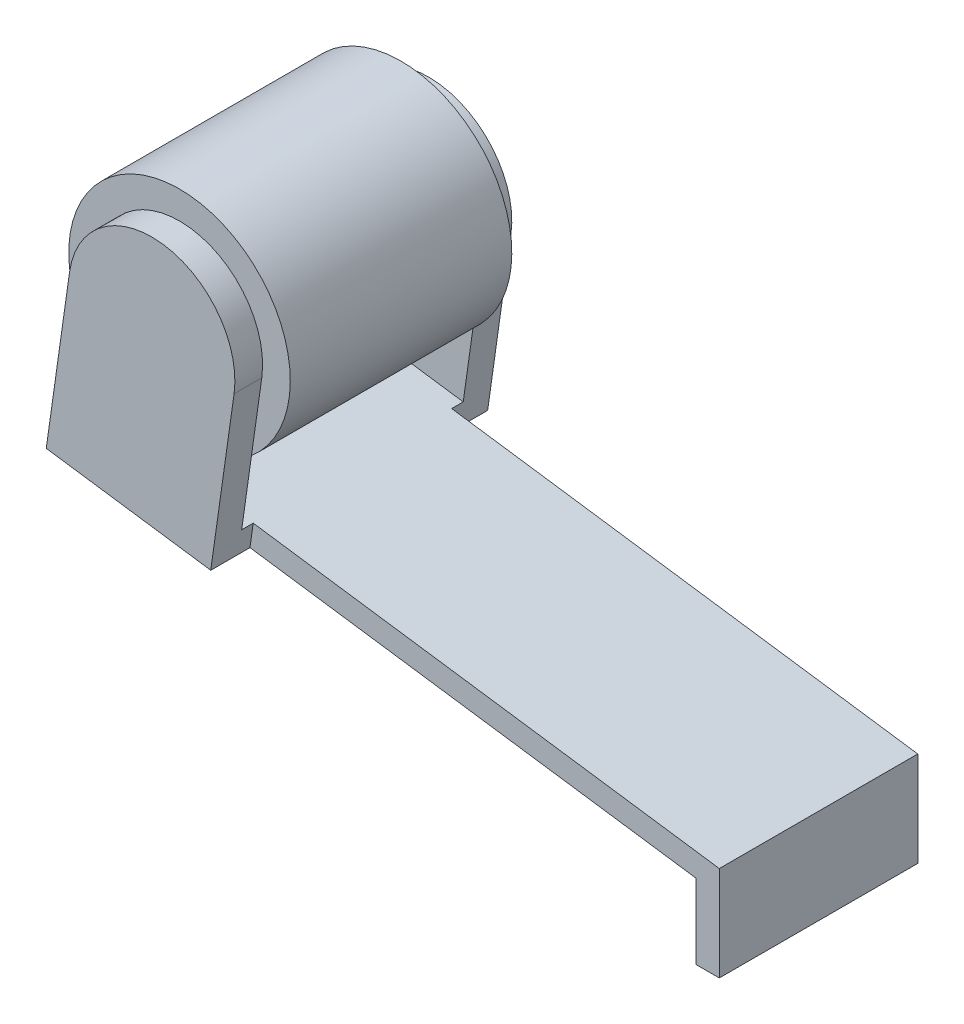
ISO-10303-21;
HEADER;
FILE_DESCRIPTION(('STEP AP214'),'2;1');
FILE_NAME('part.step','',(''),(''),'','','');
FILE_SCHEMA(('AUTOMOTIVE_DESIGN { 1 0 10303 214 1 1 1 1 }'));
ENDSEC;
DATA;
#1=APPLICATION_CONTEXT('core data for automotive mechanical design processes');
#2=APPLICATION_PROTOCOL_DEFINITION('international standard','automotive_design',2000,#1);
#3=PRODUCT_CONTEXT('',#1,'mechanical');
#4=PRODUCT('Part','Part','',(#3));
#5=PRODUCT_RELATED_PRODUCT_CATEGORY('part','',(#4));
#6=PRODUCT_DEFINITION_FORMATION('','',#4);
#7=PRODUCT_DEFINITION_CONTEXT('part definition',#1,'design');
#8=PRODUCT_DEFINITION('design','',#6,#7);
#9=PRODUCT_DEFINITION_SHAPE('','',#8);
#10=(LENGTH_UNIT() NAMED_UNIT(*) SI_UNIT(.MILLI.,.METRE.));
#11=(NAMED_UNIT(*) PLANE_ANGLE_UNIT() SI_UNIT($,.RADIAN.));
#12=(NAMED_UNIT(*) SI_UNIT($,.STERADIAN.) SOLID_ANGLE_UNIT());
#13=UNCERTAINTY_MEASURE_WITH_UNIT(LENGTH_MEASURE(1.E-05),#10,'distance_accuracy_value','');
#14=(GEOMETRIC_REPRESENTATION_CONTEXT(3) GLOBAL_UNCERTAINTY_ASSIGNED_CONTEXT((#13)) GLOBAL_UNIT_ASSIGNED_CONTEXT((#10,
#11,#12)) REPRESENTATION_CONTEXT('',''));
#15=CARTESIAN_POINT('',(0.,0.,0.));
#16=DIRECTION('',(0.,0.,1.));
#17=DIRECTION('',(1.,0.,0.));
#18=AXIS2_PLACEMENT_3D('',#15,#16,#17);
#19=CARTESIAN_POINT('',(1.47338177402257,6.86510318113821,2.4));
#20=DIRECTION('',(0.,0.,1.));
#21=DIRECTION('',(0.,-1.,0.));
#22=AXIS2_PLACEMENT_3D('',#19,#20,#21);
#23=PLANE('',#22);
#24=CARTESIAN_POINT('',(-10.9459785743594,6.80800016068567,2.4));
#25=DIRECTION('',(0.,0.,1.));
#26=DIRECTION('',(0.,-1.,0.));
#27=AXIS2_PLACEMENT_3D('',#24,#25,#26);
#28=CIRCLE('',#27,2.4);
#29=CARTESIAN_POINT('',(-12.9510067093732,5.48896180726168,2.4));
#30=VERTEX_POINT('',#29);
#31=CARTESIAN_POINT('',(-9.38665130585885,4.98358286474966,2.4));
#32=VERTEX_POINT('',#31);
#33=EDGE_CURVE('E39',#30,#32,#28,.T.);
#34=ORIENTED_EDGE('',*,*,#33,.T.);
#35=DIRECTION('',(0.140382837471843,0.990097297715408,0.));
#36=VECTOR('',#35,1.);
#37=CARTESIAN_POINT('',(-9.59898730495831,3.4860116323813,2.4));
#38=LINE('',#37,#36);
#39=CARTESIAN_POINT('',(-9.59898730495831,3.4860116323813,2.4));
#40=VERTEX_POINT('',#39);
#41=EDGE_CURVE('E209',#40,#32,#38,.T.);
#42=ORIENTED_EDGE('',*,*,#41,.F.);
#43=DIRECTION('',(-0.990097297715409,0.140382837471842,0.));
#44=VECTOR('',#43,1.);
#45=CARTESIAN_POINT('',(0.785505870410543,2.01362642233269,2.4));
#46=LINE('',#45,#44);
#47=CARTESIAN_POINT('',(-13.1633427084726,3.99139057489333,2.4));
#48=VERTEX_POINT('',#47);
#49=EDGE_CURVE('E199',#40,#48,#46,.T.);
#50=ORIENTED_EDGE('',*,*,#49,.T.);
#51=DIRECTION('',(0.140382837471842,0.990097297715409,0.));
#52=VECTOR('',#51,1.);
#53=CARTESIAN_POINT('',(-12.4754668048606,8.84286733369884,2.4));
#54=LINE('',#53,#52);
#55=EDGE_CURVE('E193',#48,#30,#54,.T.);
#56=ORIENTED_EDGE('',*,*,#55,.T.);
#57=EDGE_LOOP('',(#34,#42,#50,#56));
#58=FACE_BOUND('',#57,.T.);
#59=ADVANCED_FACE('F16',(#58),#23,.F.);
#60=CARTESIAN_POINT('',(1.47338177402257,6.86510318113821,-2.4));
#61=DIRECTION('',(0.,0.,-1.));
#62=DIRECTION('',(0.,1.,0.));
#63=AXIS2_PLACEMENT_3D('',#60,#61,#62);
#64=PLANE('',#63);
#65=CARTESIAN_POINT('',(-10.9459785743594,6.80800016068567,-2.4));
#66=DIRECTION('',(0.,0.,1.));
#67=DIRECTION('',(1.,0.,0.));
#68=AXIS2_PLACEMENT_3D('',#65,#66,#67);
#69=CIRCLE('',#68,2.4);
#70=CARTESIAN_POINT('',(-12.9510067093732,5.48896180726168,-2.4));
#71=VERTEX_POINT('',#70);
#72=CARTESIAN_POINT('',(-9.38665130585885,4.98358286474965,-2.4));
#73=VERTEX_POINT('',#72);
#74=EDGE_CURVE('E186',#71,#73,#69,.T.);
#75=ORIENTED_EDGE('',*,*,#74,.F.);
#76=DIRECTION('',(0.140382837471842,0.990097297715409,0.));
#77=VECTOR('',#76,1.);
#78=CARTESIAN_POINT('',(-13.2335341272085,3.49634192603562,-2.4));
#79=LINE('',#78,#77);
#80=CARTESIAN_POINT('',(-13.1633427084726,3.99139057489333,-2.4));
#81=VERTEX_POINT('',#80);
#82=EDGE_CURVE('E251',#81,#71,#79,.T.);
#83=ORIENTED_EDGE('',*,*,#82,.F.);
#84=DIRECTION('',(-0.990097297715409,0.140382837471842,0.));
#85=VECTOR('',#84,1.);
#86=CARTESIAN_POINT('',(0.785505870410543,2.01362642233269,-2.4));
#87=LINE('',#86,#85);
#88=CARTESIAN_POINT('',(-9.59898730495831,3.4860116323813,-2.4));
#89=VERTEX_POINT('',#88);
#90=EDGE_CURVE('E198',#89,#81,#87,.T.);
#91=ORIENTED_EDGE('',*,*,#90,.F.);
#92=DIRECTION('',(-0.140382837471843,-0.990097297715408,0.));
#93=VECTOR('',#92,1.);
#94=CARTESIAN_POINT('',(-9.59898730495831,3.4860116323813,-2.4));
#95=LINE('',#94,#93);
#96=EDGE_CURVE('E148',#73,#89,#95,.T.);
#97=ORIENTED_EDGE('',*,*,#96,.F.);
#98=EDGE_LOOP('',(#75,#83,#91,#97));
#99=FACE_BOUND('',#98,.T.);
#100=ADVANCED_FACE('F277',(#99),#64,.F.);
#101=CARTESIAN_POINT('',(-9.59898730495831,3.4860116323813,3.));
#102=DIRECTION('',(-0.990097297715408,0.140382837471843,0.));
#103=DIRECTION('',(-0.140382837471843,-0.990097297715408,0.));
#104=AXIS2_PLACEMENT_3D('',#101,#102,#103);
#105=PLANE('',#104);
#106=DIRECTION('',(0.140382837471843,0.990097297715408,0.));
#107=VECTOR('',#106,1.);
#108=CARTESIAN_POINT('',(-9.59898730495831,3.4860116323813,3.));
#109=LINE('',#108,#107);
#110=CARTESIAN_POINT('',(-9.66917872369423,2.9909629835236,3.));
#111=VERTEX_POINT('',#110);
#112=CARTESIAN_POINT('',(-9.16380087260229,6.55531068942965,3.));
#113=VERTEX_POINT('',#112);
#114=EDGE_CURVE('E220',#111,#113,#109,.T.);
#115=ORIENTED_EDGE('',*,*,#114,.F.);
#116=DIRECTION('',(0.,0.,1.));
#117=VECTOR('',#116,1.);
#118=CARTESIAN_POINT('',(-9.66917872369423,2.9909629835236,3.));
#119=LINE('',#118,#117);
#120=CARTESIAN_POINT('',(-9.66917872369423,2.99096298352359,2.15));
#121=VERTEX_POINT('',#120);
#122=EDGE_CURVE('E173',#121,#111,#119,.T.);
#123=ORIENTED_EDGE('',*,*,#122,.F.);
#124=DIRECTION('',(0.140382837471843,0.990097297715409,0.));
#125=VECTOR('',#124,1.);
#126=CARTESIAN_POINT('',(-10.1573605973967,-0.452104293439266,2.15));
#127=LINE('',#126,#125);
#128=CARTESIAN_POINT('',(-9.59898730495831,3.4860116323813,2.15));
#129=VERTEX_POINT('',#128);
#130=EDGE_CURVE('E171',#121,#129,#127,.T.);
#131=ORIENTED_EDGE('',*,*,#130,.T.);
#132=DIRECTION('',(0.,0.,1.));
#133=VECTOR('',#132,1.);
#134=CARTESIAN_POINT('',(-9.59898730495831,3.4860116323813,3.));
#135=LINE('',#134,#133);
#136=EDGE_CURVE('E169',#129,#40,#135,.T.);
#137=ORIENTED_EDGE('',*,*,#136,.T.);
#138=ORIENTED_EDGE('',*,*,#41,.T.);
#139=CARTESIAN_POINT('',(-9.16380087260229,6.55531068942965,2.4));
#140=VERTEX_POINT('',#139);
#141=EDGE_CURVE('E208',#32,#140,#38,.T.);
#142=ORIENTED_EDGE('',*,*,#141,.T.);
#143=DIRECTION('',(0.,0.,-1.));
#144=VECTOR('',#143,1.);
#145=CARTESIAN_POINT('',(-9.16380087260229,6.55531068942965,3.));
#146=LINE('',#145,#144);
#147=EDGE_CURVE('E246',#113,#140,#146,.T.);
#148=ORIENTED_EDGE('',*,*,#147,.F.);
#149=EDGE_LOOP('',(#115,#123,#131,#137,#138,#142,#148));
#150=FACE_BOUND('',#149,.T.);
#151=ADVANCED_FACE('F289',(#150),#105,.F.);
#152=CARTESIAN_POINT('',(-10.9459785743594,6.80800016068567,3.));
#153=DIRECTION('',(0.,0.,-1.));
#154=DIRECTION('',(-1.,0.,0.));
#155=AXIS2_PLACEMENT_3D('',#152,#153,#154);
#156=CYLINDRICAL_SURFACE('',#155,1.8000025915326);
#157=DIRECTION('',(0.,0.,-1.));
#158=VECTOR('',#157,1.);
#159=CARTESIAN_POINT('',(-12.7281562761166,7.06068963194168,3.));
#160=LINE('',#159,#158);
#161=CARTESIAN_POINT('',(-12.7281562761166,7.06068963194168,-2.4));
#162=VERTEX_POINT('',#161);
#163=CARTESIAN_POINT('',(-12.7281562761166,7.06068963194168,-3.));
#164=VERTEX_POINT('',#163);
#165=EDGE_CURVE('E241',#162,#164,#160,.T.);
#166=ORIENTED_EDGE('',*,*,#165,.F.);
#167=CARTESIAN_POINT('',(-10.9459785743594,6.80800016068567,-2.4));
#168=DIRECTION('',(0.,0.,-1.));
#169=DIRECTION('',(0.,1.,0.));
#170=AXIS2_PLACEMENT_3D('',#167,#168,#169);
#171=CIRCLE('',#170,1.8000025915326);
#172=CARTESIAN_POINT('',(-9.16380087260229,6.55531068942965,-2.4));
#173=VERTEX_POINT('',#172);
#174=EDGE_CURVE('E201',#162,#173,#171,.T.);
#175=ORIENTED_EDGE('',*,*,#174,.T.);
#176=CARTESIAN_POINT('',(-9.16380087260229,6.55531068942965,-3.));
#177=VERTEX_POINT('',#176);
#178=EDGE_CURVE('E245',#173,#177,#146,.T.);
#179=ORIENTED_EDGE('',*,*,#178,.T.);
#180=CARTESIAN_POINT('',(-10.9459785743594,6.80800016068567,-3.));
#181=DIRECTION('',(0.,0.,1.));
#182=DIRECTION('',(-1.,0.,0.));
#183=AXIS2_PLACEMENT_3D('',#180,#181,#182);
#184=CIRCLE('',#183,1.8000025915326);
#185=EDGE_CURVE('E212',#177,#164,#184,.T.);
#186=ORIENTED_EDGE('',*,*,#185,.T.);
#187=EDGE_LOOP('',(#166,#175,#179,#186));
#188=FACE_BOUND('',#187,.T.);
#189=ADVANCED_FACE('F269',(#188),#156,.T.);
#190=CARTESIAN_POINT('',(0.500000000000028,0.,3.));
#191=DIRECTION('',(-1.,0.,0.));
#192=DIRECTION('',(0.,0.,1.));
#193=AXIS2_PLACEMENT_3D('',#190,#191,#192);
#194=PLANE('',#193);
#195=DIRECTION('',(0.,0.,-1.));
#196=VECTOR('',#195,1.);
#197=CARTESIAN_POINT('',(0.500000000000028,0.,3.));
#198=LINE('',#197,#196);
#199=CARTESIAN_POINT('',(0.500000000000028,0.,2.15));
#200=VERTEX_POINT('',#199);
#201=CARTESIAN_POINT('',(0.500000000000028,0.,-2.15));
#202=VERTEX_POINT('',#201);
#203=EDGE_CURVE('E229',#200,#202,#198,.T.);
#204=ORIENTED_EDGE('',*,*,#203,.T.);
#205=DIRECTION('',(0.,1.,0.));
#206=VECTOR('',#205,1.);
#207=CARTESIAN_POINT('',(0.500000000000028,0.,-2.15));
#208=LINE('',#207,#206);
#209=CARTESIAN_POINT('',(0.500000000000028,2.0541074177819,-2.15));
#210=VERTEX_POINT('',#209);
#211=EDGE_CURVE('E164',#202,#210,#208,.T.);
#212=ORIENTED_EDGE('',*,*,#211,.T.);
#213=DIRECTION('',(0.,0.,-1.));
#214=VECTOR('',#213,1.);
#215=CARTESIAN_POINT('',(0.500000000000028,2.0541074177819,3.));
#216=LINE('',#215,#214);
#217=CARTESIAN_POINT('',(0.500000000000028,2.0541074177819,2.15));
#218=VERTEX_POINT('',#217);
#219=EDGE_CURVE('E156',#218,#210,#216,.T.);
#220=ORIENTED_EDGE('',*,*,#219,.F.);
#221=DIRECTION('',(0.,-1.,0.));
#222=VECTOR('',#221,1.);
#223=CARTESIAN_POINT('',(0.500000000000028,0.,2.15));
#224=LINE('',#223,#222);
#225=EDGE_CURVE('E182',#218,#200,#224,.T.);
#226=ORIENTED_EDGE('',*,*,#225,.T.);
#227=EDGE_LOOP('',(#204,#212,#220,#226));
#228=FACE_BOUND('',#227,.T.);
#229=ADVANCED_FACE('F18',(#228),#194,.F.);
#230=CARTESIAN_POINT('',(-9.59898730495831,3.4860116323813,3.));
#231=DIRECTION('',(-0.140382837471843,-0.990097297715409,0.));
#232=DIRECTION('',(0.990097297715409,-0.140382837471843,0.));
#233=AXIS2_PLACEMENT_3D('',#230,#231,#232);
#234=PLANE('',#233);
#235=ORIENTED_EDGE('',*,*,#219,.T.);
#236=DIRECTION('',(0.990097297715408,-0.140382837471842,0.));
#237=VECTOR('',#236,1.);
#238=CARTESIAN_POINT('',(0.785505870410545,2.01362642233269,-2.15));
#239=LINE('',#238,#237);
#240=CARTESIAN_POINT('',(-9.59898730495831,3.4860116323813,-2.15));
#241=VERTEX_POINT('',#240);
#242=EDGE_CURVE('E135',#241,#210,#239,.T.);
#243=ORIENTED_EDGE('',*,*,#242,.F.);
#244=DIRECTION('',(0.,0.,1.));
#245=VECTOR('',#244,1.);
#246=CARTESIAN_POINT('',(-9.59898730495831,3.4860116323813,-2.15));
#247=LINE('',#246,#245);
#248=EDGE_CURVE('E144',#89,#241,#247,.T.);
#249=ORIENTED_EDGE('',*,*,#248,.F.);
#250=ORIENTED_EDGE('',*,*,#90,.T.);
#251=DIRECTION('',(0.,0.,1.));
#252=VECTOR('',#251,1.);
#253=CARTESIAN_POINT('',(-13.1633427084726,3.99139057489333,-2.4));
#254=LINE('',#253,#252);
#255=EDGE_CURVE('E195',#81,#48,#254,.T.);
#256=ORIENTED_EDGE('',*,*,#255,.T.);
#257=ORIENTED_EDGE('',*,*,#49,.F.);
#258=ORIENTED_EDGE('',*,*,#136,.F.);
#259=DIRECTION('',(-0.990097297715408,0.140382837471842,0.));
#260=VECTOR('',#259,1.);
#261=CARTESIAN_POINT('',(0.785505870410545,2.01362642233269,2.15));
#262=LINE('',#261,#260);
#263=EDGE_CURVE('E166',#218,#129,#262,.T.);
#264=ORIENTED_EDGE('',*,*,#263,.F.);
#265=EDGE_LOOP('',(#235,#243,#249,#250,#256,#257,#258,#264));
#266=FACE_BOUND('',#265,.T.);
#267=ADVANCED_FACE('F153',(#266),#234,.F.);
#268=ORIENTED_EDGE('',*,*,#178,.F.);
#269=EDGE_CURVE('E204',#173,#73,#95,.T.);
#270=ORIENTED_EDGE('',*,*,#269,.T.);
#271=ORIENTED_EDGE('',*,*,#96,.T.);
#272=ORIENTED_EDGE('',*,*,#248,.T.);
#273=DIRECTION('',(0.140382837471843,0.990097297715409,0.));
#274=VECTOR('',#273,1.);
#275=CARTESIAN_POINT('',(-10.1573605973967,-0.452104293439266,-2.15));
#276=LINE('',#275,#274);
#277=CARTESIAN_POINT('',(-9.66917872369423,2.9909629835236,-2.15));
#278=VERTEX_POINT('',#277);
#279=EDGE_CURVE('E131',#278,#241,#276,.T.);
#280=ORIENTED_EDGE('',*,*,#279,.F.);
#281=DIRECTION('',(0.,0.,1.));
#282=VECTOR('',#281,1.);
#283=CARTESIAN_POINT('',(-9.66917872369425,2.9909629835236,2.99999999999996));
#284=LINE('',#283,#282);
#285=CARTESIAN_POINT('',(-9.66917872369423,2.99096298352359,-3.));
#286=VERTEX_POINT('',#285);
#287=EDGE_CURVE('E141',#286,#278,#284,.T.);
#288=ORIENTED_EDGE('',*,*,#287,.F.);
#289=DIRECTION('',(0.140382837471843,0.990097297715408,0.));
#290=VECTOR('',#289,1.);
#291=CARTESIAN_POINT('',(-9.59898730495831,3.4860116323813,-3.));
#292=LINE('',#291,#290);
#293=EDGE_CURVE('E31',#286,#177,#292,.T.);
#294=ORIENTED_EDGE('',*,*,#293,.T.);
#295=EDGE_LOOP('',(#268,#270,#271,#272,#280,#288,#294));
#296=FACE_BOUND('',#295,.T.);
#297=ADVANCED_FACE('F146',(#296),#105,.F.);
#298=CARTESIAN_POINT('',(-10.9459785743594,6.80800016068567,2.4));
#299=DIRECTION('',(0.,0.,1.));
#300=DIRECTION('',(0.,-1.,0.));
#301=AXIS2_PLACEMENT_3D('',#298,#299,#300);
#302=CIRCLE('',#301,1.8000025915326);
#303=CARTESIAN_POINT('',(-12.7281562761166,7.06068963194168,2.4));
#304=VERTEX_POINT('',#303);
#305=EDGE_CURVE('E206',#140,#304,#302,.T.);
#306=ORIENTED_EDGE('',*,*,#305,.T.);
#307=CARTESIAN_POINT('',(-12.7281562761166,7.06068963194168,3.));
#308=VERTEX_POINT('',#307);
#309=EDGE_CURVE('E242',#308,#304,#160,.T.);
#310=ORIENTED_EDGE('',*,*,#309,.F.);
#311=CARTESIAN_POINT('',(-10.9459785743594,6.80800016068567,3.));
#312=DIRECTION('',(0.,0.,1.));
#313=DIRECTION('',(-1.,0.,0.));
#314=AXIS2_PLACEMENT_3D('',#311,#312,#313);
#315=CIRCLE('',#314,1.8000025915326);
#316=EDGE_CURVE('E222',#113,#308,#315,.T.);
#317=ORIENTED_EDGE('',*,*,#316,.F.);
#318=ORIENTED_EDGE('',*,*,#147,.T.);
#319=EDGE_LOOP('',(#306,#310,#317,#318));
#320=FACE_BOUND('',#319,.T.);
#321=ADVANCED_FACE('F330',(#320),#156,.T.);
#322=CARTESIAN_POINT('',(-13.2335341272085,3.49634192603562,3.));
#323=DIRECTION('',(0.990097297715409,-0.140382837471842,0.));
#324=DIRECTION('',(0.140382837471842,0.990097297715409,0.));
#325=AXIS2_PLACEMENT_3D('',#322,#323,#324);
#326=PLANE('',#325);
#327=ORIENTED_EDGE('',*,*,#309,.T.);
#328=EDGE_CURVE('E192',#30,#304,#54,.T.);
#329=ORIENTED_EDGE('',*,*,#328,.F.);
#330=ORIENTED_EDGE('',*,*,#55,.F.);
#331=ORIENTED_EDGE('',*,*,#255,.F.);
#332=ORIENTED_EDGE('',*,*,#82,.T.);
#333=EDGE_CURVE('E250',#71,#162,#79,.T.);
#334=ORIENTED_EDGE('',*,*,#333,.T.);
#335=ORIENTED_EDGE('',*,*,#165,.T.);
#336=DIRECTION('',(-0.140382837471842,-0.990097297715409,0.));
#337=VECTOR('',#336,1.);
#338=CARTESIAN_POINT('',(-13.2335341272085,3.49634192603562,-3.));
#339=LINE('',#338,#337);
#340=CARTESIAN_POINT('',(-13.2335341272085,3.49634192603562,-3.));
#341=VERTEX_POINT('',#340);
#342=EDGE_CURVE('E215',#164,#341,#339,.T.);
#343=ORIENTED_EDGE('',*,*,#342,.T.);
#344=DIRECTION('',(0.,0.,-1.));
#345=VECTOR('',#344,1.);
#346=CARTESIAN_POINT('',(-13.2335341272085,3.49634192603562,3.));
#347=LINE('',#346,#345);
#348=CARTESIAN_POINT('',(-13.2335341272085,3.49634192603562,3.));
#349=VERTEX_POINT('',#348);
#350=EDGE_CURVE('E238',#349,#341,#347,.T.);
#351=ORIENTED_EDGE('',*,*,#350,.F.);
#352=DIRECTION('',(-0.140382837471842,-0.990097297715409,0.));
#353=VECTOR('',#352,1.);
#354=CARTESIAN_POINT('',(-13.2335341272085,3.49634192603562,3.));
#355=LINE('',#354,#353);
#356=EDGE_CURVE('E224',#308,#349,#355,.T.);
#357=ORIENTED_EDGE('',*,*,#356,.F.);
#358=EDGE_LOOP('',(#327,#329,#330,#331,#332,#334,#335,#343,#351,#357));
#359=FACE_BOUND('',#358,.T.);
#360=ADVANCED_FACE('F285',(#359),#326,.F.);
#361=CARTESIAN_POINT('',(0.,1.62,3.));
#362=DIRECTION('',(0.140382837471842,0.990097297715408,0.));
#363=DIRECTION('',(-0.990097297715409,0.140382837471842,0.));
#364=AXIS2_PLACEMENT_3D('',#361,#362,#363);
#365=PLANE('',#364);
#366=ORIENTED_EDGE('',*,*,#287,.T.);
#367=DIRECTION('',(0.990097297715409,-0.140382837471842,0.));
#368=VECTOR('',#367,1.);
#369=CARTESIAN_POINT('',(0.,1.62,-2.15));
#370=LINE('',#369,#368);
#371=CARTESIAN_POINT('',(0.,1.62,-2.15));
#372=VERTEX_POINT('',#371);
#373=EDGE_CURVE('E138',#278,#372,#370,.T.);
#374=ORIENTED_EDGE('',*,*,#373,.T.);
#375=DIRECTION('',(0.,0.,-1.));
#376=VECTOR('',#375,1.);
#377=CARTESIAN_POINT('',(0.,1.62,3.));
#378=LINE('',#377,#376);
#379=CARTESIAN_POINT('',(0.,1.62,2.15));
#380=VERTEX_POINT('',#379);
#381=EDGE_CURVE('E235',#380,#372,#378,.T.);
#382=ORIENTED_EDGE('',*,*,#381,.F.);
#383=DIRECTION('',(-0.990097297715409,0.140382837471842,0.));
#384=VECTOR('',#383,1.);
#385=CARTESIAN_POINT('',(0.,1.62,2.15));
#386=LINE('',#385,#384);
#387=EDGE_CURVE('E179',#380,#121,#386,.T.);
#388=ORIENTED_EDGE('',*,*,#387,.T.);
#389=ORIENTED_EDGE('',*,*,#122,.T.);
#390=DIRECTION('',(0.990097297715409,-0.140382837471842,0.));
#391=VECTOR('',#390,1.);
#392=CARTESIAN_POINT('',(0.,1.62,3.));
#393=LINE('',#392,#391);
#394=EDGE_CURVE('E226',#349,#111,#393,.T.);
#395=ORIENTED_EDGE('',*,*,#394,.F.);
#396=ORIENTED_EDGE('',*,*,#350,.T.);
#397=DIRECTION('',(0.990097297715409,-0.140382837471842,0.));
#398=VECTOR('',#397,1.);
#399=CARTESIAN_POINT('',(0.,1.62,-3.));
#400=LINE('',#399,#398);
#401=EDGE_CURVE('E217',#341,#286,#400,.T.);
#402=ORIENTED_EDGE('',*,*,#401,.T.);
#403=EDGE_LOOP('',(#366,#374,#382,#388,#389,#395,#396,#402));
#404=FACE_BOUND('',#403,.T.);
#405=ADVANCED_FACE('F263',(#404),#365,.F.);
#406=CARTESIAN_POINT('',(0.,1.62,3.));
#407=DIRECTION('',(1.,0.,0.));
#408=DIRECTION('',(0.,1.,0.));
#409=AXIS2_PLACEMENT_3D('',#406,#407,#408);
#410=PLANE('',#409);
#411=ORIENTED_EDGE('',*,*,#381,.T.);
#412=DIRECTION('',(0.,-1.,0.));
#413=VECTOR('',#412,1.);
#414=CARTESIAN_POINT('',(0.,1.62,-2.15));
#415=LINE('',#414,#413);
#416=CARTESIAN_POINT('',(0.,0.,-2.15));
#417=VERTEX_POINT('',#416);
#418=EDGE_CURVE('E160',#372,#417,#415,.T.);
#419=ORIENTED_EDGE('',*,*,#418,.T.);
#420=DIRECTION('',(0.,0.,-1.));
#421=VECTOR('',#420,1.);
#422=CARTESIAN_POINT('',(0.,0.,3.));
#423=LINE('',#422,#421);
#424=CARTESIAN_POINT('',(0.,0.,2.15));
#425=VERTEX_POINT('',#424);
#426=EDGE_CURVE('E232',#425,#417,#423,.T.);
#427=ORIENTED_EDGE('',*,*,#426,.F.);
#428=DIRECTION('',(0.,1.,0.));
#429=VECTOR('',#428,1.);
#430=CARTESIAN_POINT('',(0.,1.62,2.15));
#431=LINE('',#430,#429);
#432=EDGE_CURVE('E176',#425,#380,#431,.T.);
#433=ORIENTED_EDGE('',*,*,#432,.T.);
#434=EDGE_LOOP('',(#411,#419,#427,#433));
#435=FACE_BOUND('',#434,.T.);
#436=ADVANCED_FACE('F260',(#435),#410,.F.);
#437=CARTESIAN_POINT('',(0.,0.,3.));
#438=DIRECTION('',(0.,1.,0.));
#439=DIRECTION('',(0.,0.,1.));
#440=AXIS2_PLACEMENT_3D('',#437,#438,#439);
#441=PLANE('',#440);
#442=ORIENTED_EDGE('',*,*,#426,.T.);
#443=DIRECTION('',(1.,0.,0.));
#444=VECTOR('',#443,1.);
#445=CARTESIAN_POINT('',(0.,0.,-2.15));
#446=LINE('',#445,#444);
#447=EDGE_CURVE('E11',#417,#202,#446,.T.);
#448=ORIENTED_EDGE('',*,*,#447,.T.);
#449=ORIENTED_EDGE('',*,*,#203,.F.);
#450=DIRECTION('',(-1.,0.,0.));
#451=VECTOR('',#450,1.);
#452=CARTESIAN_POINT('',(0.,0.,2.15));
#453=LINE('',#452,#451);
#454=EDGE_CURVE('E24',#200,#425,#453,.T.);
#455=ORIENTED_EDGE('',*,*,#454,.T.);
#456=EDGE_LOOP('',(#442,#448,#449,#455));
#457=FACE_BOUND('',#456,.T.);
#458=ADVANCED_FACE('F257',(#457),#441,.F.);
#459=CARTESIAN_POINT('',(-10.9459785743594,6.80800016068567,3.));
#460=DIRECTION('',(0.,0.,-1.));
#461=DIRECTION('',(-1.,0.,0.));
#462=AXIS2_PLACEMENT_3D('',#459,#460,#461);
#463=PLANE('',#462);
#464=ORIENTED_EDGE('',*,*,#394,.T.);
#465=ORIENTED_EDGE('',*,*,#114,.T.);
#466=ORIENTED_EDGE('',*,*,#316,.T.);
#467=ORIENTED_EDGE('',*,*,#356,.T.);
#468=EDGE_LOOP('',(#464,#465,#466,#467));
#469=FACE_BOUND('',#468,.T.);
#470=ADVANCED_FACE('F318',(#469),#463,.F.);
#471=CARTESIAN_POINT('',(-10.9459785743594,6.80800016068567,-3.));
#472=DIRECTION('',(0.,0.,-1.));
#473=DIRECTION('',(-1.,0.,0.));
#474=AXIS2_PLACEMENT_3D('',#471,#472,#473);
#475=PLANE('',#474);
#476=ORIENTED_EDGE('',*,*,#293,.F.);
#477=ORIENTED_EDGE('',*,*,#401,.F.);
#478=ORIENTED_EDGE('',*,*,#342,.F.);
#479=ORIENTED_EDGE('',*,*,#185,.F.);
#480=EDGE_LOOP('',(#476,#477,#478,#479));
#481=FACE_BOUND('',#480,.T.);
#482=ADVANCED_FACE('F266',(#481),#475,.T.);
#483=CARTESIAN_POINT('',(-10.9459785743594,6.80800016068567,-2.4));
#484=DIRECTION('',(0.,0.,1.));
#485=DIRECTION('',(1.,0.,0.));
#486=AXIS2_PLACEMENT_3D('',#483,#484,#485);
#487=PLANE('',#486);
#488=EDGE_CURVE('E185',#73,#71,#69,.T.);
#489=ORIENTED_EDGE('',*,*,#488,.F.);
#490=ORIENTED_EDGE('',*,*,#269,.F.);
#491=ORIENTED_EDGE('',*,*,#174,.F.);
#492=ORIENTED_EDGE('',*,*,#333,.F.);
#493=EDGE_LOOP('',(#489,#490,#491,#492));
#494=FACE_BOUND('',#493,.T.);
#495=ADVANCED_FACE('F274',(#494),#487,.F.);
#496=CARTESIAN_POINT('',(1.47338177402257,6.86510318113821,2.4));
#497=DIRECTION('',(0.,0.,1.));
#498=DIRECTION('',(0.,-1.,0.));
#499=AXIS2_PLACEMENT_3D('',#496,#497,#498);
#500=PLANE('',#499);
#501=ORIENTED_EDGE('',*,*,#141,.F.);
#502=EDGE_CURVE('E189',#32,#30,#28,.T.);
#503=ORIENTED_EDGE('',*,*,#502,.T.);
#504=ORIENTED_EDGE('',*,*,#328,.T.);
#505=ORIENTED_EDGE('',*,*,#305,.F.);
#506=EDGE_LOOP('',(#501,#503,#504,#505));
#507=FACE_BOUND('',#506,.T.);
#508=ADVANCED_FACE('F294',(#507),#500,.T.);
#509=CARTESIAN_POINT('',(-10.9459785743594,6.80800016068567,9.18822509939086));
#510=DIRECTION('',(0.,0.,-1.));
#511=DIRECTION('',(-1.,0.,0.));
#512=AXIS2_PLACEMENT_3D('',#509,#510,#511);
#513=CYLINDRICAL_SURFACE('',#512,2.4);
#514=ORIENTED_EDGE('',*,*,#74,.T.);
#515=ORIENTED_EDGE('',*,*,#488,.T.);
#516=EDGE_LOOP('',(#514,#515));
#517=FACE_BOUND('',#516,.T.);
#518=ORIENTED_EDGE('',*,*,#502,.F.);
#519=ORIENTED_EDGE('',*,*,#33,.F.);
#520=EDGE_LOOP('',(#518,#519));
#521=FACE_BOUND('',#520,.T.);
#522=ADVANCED_FACE('F296',(#517,#521),#513,.T.);
#523=CARTESIAN_POINT('',(0.227132577972117,-1.92448950348788,2.15));
#524=DIRECTION('',(0.,0.,-1.));
#525=DIRECTION('',(-1.,0.,0.));
#526=AXIS2_PLACEMENT_3D('',#523,#524,#525);
#527=PLANE('',#526);
#528=ORIENTED_EDGE('',*,*,#263,.T.);
#529=ORIENTED_EDGE('',*,*,#130,.F.);
#530=ORIENTED_EDGE('',*,*,#387,.F.);
#531=ORIENTED_EDGE('',*,*,#432,.F.);
#532=ORIENTED_EDGE('',*,*,#454,.F.);
#533=ORIENTED_EDGE('',*,*,#225,.F.);
#534=EDGE_LOOP('',(#528,#529,#530,#531,#532,#533));
#535=FACE_BOUND('',#534,.T.);
#536=ADVANCED_FACE('F298',(#535),#527,.F.);
#537=CARTESIAN_POINT('',(0.227132577972117,-1.92448950348788,-2.15));
#538=DIRECTION('',(0.,0.,1.));
#539=DIRECTION('',(1.,0.,0.));
#540=AXIS2_PLACEMENT_3D('',#537,#538,#539);
#541=PLANE('',#540);
#542=ORIENTED_EDGE('',*,*,#447,.F.);
#543=ORIENTED_EDGE('',*,*,#418,.F.);
#544=ORIENTED_EDGE('',*,*,#373,.F.);
#545=ORIENTED_EDGE('',*,*,#279,.T.);
#546=ORIENTED_EDGE('',*,*,#242,.T.);
#547=ORIENTED_EDGE('',*,*,#211,.F.);
#548=EDGE_LOOP('',(#542,#543,#544,#545,#546,#547));
#549=FACE_BOUND('',#548,.T.);
#550=ADVANCED_FACE('F133',(#549),#541,.F.);
#551=CLOSED_SHELL('',(#59,#100,#151,#189,#229,#267,#297,#321,#360,#405,#436,#458,#470,#482,#495,
#508,#522,#536,#550));
#552=MANIFOLD_SOLID_BREP('B1',#551);
#553=ADVANCED_BREP_SHAPE_REPRESENTATION('',(#18,#552),#14);
#554=SHAPE_DEFINITION_REPRESENTATION(#9,#553);
ENDSEC;
END-ISO-10303-21;
